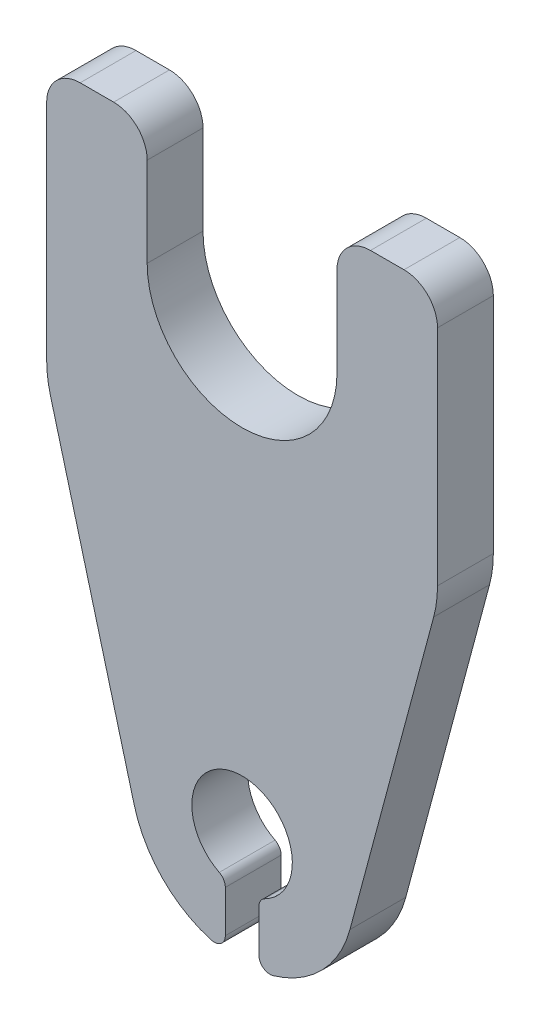
ISO-10303-21;
HEADER;
FILE_DESCRIPTION(('STEP AP214'),'2;1');
FILE_NAME('part.step','',(''),(''),'','','');
FILE_SCHEMA(('AUTOMOTIVE_DESIGN { 1 0 10303 214 1 1 1 1 }'));
ENDSEC;
DATA;
#1=APPLICATION_CONTEXT('core data for automotive mechanical design processes');
#2=APPLICATION_PROTOCOL_DEFINITION('international standard','automotive_design',2000,#1);
#3=PRODUCT_CONTEXT('',#1,'mechanical');
#4=PRODUCT('Part','Part','',(#3));
#5=PRODUCT_RELATED_PRODUCT_CATEGORY('part','',(#4));
#6=PRODUCT_DEFINITION_FORMATION('','',#4);
#7=PRODUCT_DEFINITION_CONTEXT('part definition',#1,'design');
#8=PRODUCT_DEFINITION('design','',#6,#7);
#9=PRODUCT_DEFINITION_SHAPE('','',#8);
#10=(LENGTH_UNIT() NAMED_UNIT(*) SI_UNIT(.MILLI.,.METRE.));
#11=(NAMED_UNIT(*) PLANE_ANGLE_UNIT() SI_UNIT($,.RADIAN.));
#12=(NAMED_UNIT(*) SI_UNIT($,.STERADIAN.) SOLID_ANGLE_UNIT());
#13=UNCERTAINTY_MEASURE_WITH_UNIT(LENGTH_MEASURE(1.E-05),#10,'distance_accuracy_value','');
#14=(GEOMETRIC_REPRESENTATION_CONTEXT(3) GLOBAL_UNCERTAINTY_ASSIGNED_CONTEXT((#13)) GLOBAL_UNIT_ASSIGNED_CONTEXT((#10,
#11,#12)) REPRESENTATION_CONTEXT('',''));
#15=CARTESIAN_POINT('',(0.,0.,0.));
#16=DIRECTION('',(0.,0.,1.));
#17=DIRECTION('',(1.,0.,0.));
#18=AXIS2_PLACEMENT_3D('',#15,#16,#17);
#19=CARTESIAN_POINT('',(0.,40.,5.));
#20=DIRECTION('',(0.,0.,-1.));
#21=DIRECTION('',(-1.,0.,0.));
#22=AXIS2_PLACEMENT_3D('',#19,#20,#21);
#23=CYLINDRICAL_SURFACE('',#22,8.5);
#24=CARTESIAN_POINT('',(0.,40.,0.));
#25=DIRECTION('',(0.,0.,-1.));
#26=DIRECTION('',(1.,0.,0.));
#27=AXIS2_PLACEMENT_3D('',#24,#25,#26);
#28=CIRCLE('',#27,8.5);
#29=CARTESIAN_POINT('',(8.5,40.,0.));
#30=VERTEX_POINT('',#29);
#31=CARTESIAN_POINT('',(-8.5,40.,0.));
#32=VERTEX_POINT('',#31);
#33=EDGE_CURVE('E231',#30,#32,#28,.T.);
#34=ORIENTED_EDGE('',*,*,#33,.T.);
#35=DIRECTION('',(0.,0.,-1.));
#36=VECTOR('',#35,1.);
#37=CARTESIAN_POINT('',(-8.5,40.,5.));
#38=LINE('',#37,#36);
#39=CARTESIAN_POINT('',(-8.5,40.,5.));
#40=VERTEX_POINT('',#39);
#41=EDGE_CURVE('E11',#40,#32,#38,.T.);
#42=ORIENTED_EDGE('',*,*,#41,.F.);
#43=CARTESIAN_POINT('',(0.,40.,5.));
#44=DIRECTION('',(0.,0.,-1.));
#45=DIRECTION('',(1.,0.,0.));
#46=AXIS2_PLACEMENT_3D('',#43,#44,#45);
#47=CIRCLE('',#46,8.5);
#48=CARTESIAN_POINT('',(8.5,40.,5.));
#49=VERTEX_POINT('',#48);
#50=EDGE_CURVE('E277',#49,#40,#47,.T.);
#51=ORIENTED_EDGE('',*,*,#50,.F.);
#52=DIRECTION('',(0.,0.,-1.));
#53=VECTOR('',#52,1.);
#54=CARTESIAN_POINT('',(8.5,40.,5.));
#55=LINE('',#54,#53);
#56=EDGE_CURVE('E227',#49,#30,#55,.T.);
#57=ORIENTED_EDGE('',*,*,#56,.T.);
#58=EDGE_LOOP('',(#34,#42,#51,#57));
#59=FACE_BOUND('',#58,.T.);
#60=ADVANCED_FACE('F39',(#59),#23,.F.);
#61=CARTESIAN_POINT('',(-8.5,40.,5.));
#62=DIRECTION('',(-1.,0.,0.));
#63=DIRECTION('',(0.,0.,1.));
#64=AXIS2_PLACEMENT_3D('',#61,#62,#63);
#65=PLANE('',#64);
#66=DIRECTION('',(0.,1.,0.));
#67=VECTOR('',#66,1.);
#68=CARTESIAN_POINT('',(-8.5,40.,0.));
#69=LINE('',#68,#67);
#70=CARTESIAN_POINT('',(-8.5,48.,0.));
#71=VERTEX_POINT('',#70);
#72=EDGE_CURVE('E234',#32,#71,#69,.T.);
#73=ORIENTED_EDGE('',*,*,#72,.T.);
#74=DIRECTION('',(0.,0.,-1.));
#75=VECTOR('',#74,1.);
#76=CARTESIAN_POINT('',(-8.5,48.,5.));
#77=LINE('',#76,#75);
#78=CARTESIAN_POINT('',(-8.5,48.,5.));
#79=VERTEX_POINT('',#78);
#80=EDGE_CURVE('E47',#79,#71,#77,.T.);
#81=ORIENTED_EDGE('',*,*,#80,.F.);
#82=DIRECTION('',(0.,1.,0.));
#83=VECTOR('',#82,1.);
#84=CARTESIAN_POINT('',(-8.5,40.,5.));
#85=LINE('',#84,#83);
#86=EDGE_CURVE('E146',#40,#79,#85,.T.);
#87=ORIENTED_EDGE('',*,*,#86,.F.);
#88=ORIENTED_EDGE('',*,*,#41,.T.);
#89=EDGE_LOOP('',(#73,#81,#87,#88));
#90=FACE_BOUND('',#89,.T.);
#91=ADVANCED_FACE('F415',(#90),#65,.F.);
#92=CARTESIAN_POINT('',(-11.5,48.,5.));
#93=DIRECTION('',(0.,0.,-1.));
#94=DIRECTION('',(-1.,0.,0.));
#95=AXIS2_PLACEMENT_3D('',#92,#93,#94);
#96=CYLINDRICAL_SURFACE('',#95,3.);
#97=CARTESIAN_POINT('',(-11.5,48.,0.));
#98=DIRECTION('',(0.,0.,1.));
#99=DIRECTION('',(1.,0.,0.));
#100=AXIS2_PLACEMENT_3D('',#97,#98,#99);
#101=CIRCLE('',#100,3.);
#102=CARTESIAN_POINT('',(-11.5,51.,0.));
#103=VERTEX_POINT('',#102);
#104=EDGE_CURVE('E236',#71,#103,#101,.T.);
#105=ORIENTED_EDGE('',*,*,#104,.T.);
#106=DIRECTION('',(0.,0.,-1.));
#107=VECTOR('',#106,1.);
#108=CARTESIAN_POINT('',(-11.5,51.,5.));
#109=LINE('',#108,#107);
#110=CARTESIAN_POINT('',(-11.5,51.,5.));
#111=VERTEX_POINT('',#110);
#112=EDGE_CURVE('E332',#111,#103,#109,.T.);
#113=ORIENTED_EDGE('',*,*,#112,.F.);
#114=CARTESIAN_POINT('',(-11.5,48.,5.));
#115=DIRECTION('',(0.,0.,1.));
#116=DIRECTION('',(1.,0.,0.));
#117=AXIS2_PLACEMENT_3D('',#114,#115,#116);
#118=CIRCLE('',#117,3.);
#119=EDGE_CURVE('E340',#79,#111,#118,.T.);
#120=ORIENTED_EDGE('',*,*,#119,.F.);
#121=ORIENTED_EDGE('',*,*,#80,.T.);
#122=EDGE_LOOP('',(#105,#113,#120,#121));
#123=FACE_BOUND('',#122,.T.);
#124=ADVANCED_FACE('F338',(#123),#96,.T.);
#125=CARTESIAN_POINT('',(-11.5,51.,5.));
#126=DIRECTION('',(0.,-1.,0.));
#127=DIRECTION('',(0.,0.,-1.));
#128=AXIS2_PLACEMENT_3D('',#125,#126,#127);
#129=PLANE('',#128);
#130=DIRECTION('',(-1.,0.,0.));
#131=VECTOR('',#130,1.);
#132=CARTESIAN_POINT('',(-11.5,51.,0.));
#133=LINE('',#132,#131);
#134=CARTESIAN_POINT('',(-14.5,51.,0.));
#135=VERTEX_POINT('',#134);
#136=EDGE_CURVE('E238',#103,#135,#133,.T.);
#137=ORIENTED_EDGE('',*,*,#136,.T.);
#138=DIRECTION('',(0.,0.,-1.));
#139=VECTOR('',#138,1.);
#140=CARTESIAN_POINT('',(-14.5,51.,5.));
#141=LINE('',#140,#139);
#142=CARTESIAN_POINT('',(-14.5,51.,5.));
#143=VERTEX_POINT('',#142);
#144=EDGE_CURVE('E329',#143,#135,#141,.T.);
#145=ORIENTED_EDGE('',*,*,#144,.F.);
#146=DIRECTION('',(-1.,0.,0.));
#147=VECTOR('',#146,1.);
#148=CARTESIAN_POINT('',(-11.5,51.,5.));
#149=LINE('',#148,#147);
#150=EDGE_CURVE('E358',#111,#143,#149,.T.);
#151=ORIENTED_EDGE('',*,*,#150,.F.);
#152=ORIENTED_EDGE('',*,*,#112,.T.);
#153=EDGE_LOOP('',(#137,#145,#151,#152));
#154=FACE_BOUND('',#153,.T.);
#155=ADVANCED_FACE('F349',(#154),#129,.F.);
#156=CARTESIAN_POINT('',(-14.5,48.,5.));
#157=DIRECTION('',(0.,0.,-1.));
#158=DIRECTION('',(-1.,0.,0.));
#159=AXIS2_PLACEMENT_3D('',#156,#157,#158);
#160=CYLINDRICAL_SURFACE('',#159,3.);
#161=CARTESIAN_POINT('',(-14.5,48.,0.));
#162=DIRECTION('',(0.,0.,1.));
#163=DIRECTION('',(-1.,0.,0.));
#164=AXIS2_PLACEMENT_3D('',#161,#162,#163);
#165=CIRCLE('',#164,3.);
#166=CARTESIAN_POINT('',(-17.5,48.,0.));
#167=VERTEX_POINT('',#166);
#168=EDGE_CURVE('E240',#135,#167,#165,.T.);
#169=ORIENTED_EDGE('',*,*,#168,.T.);
#170=DIRECTION('',(0.,0.,-1.));
#171=VECTOR('',#170,1.);
#172=CARTESIAN_POINT('',(-17.5,48.,5.));
#173=LINE('',#172,#171);
#174=CARTESIAN_POINT('',(-17.5,48.,5.));
#175=VERTEX_POINT('',#174);
#176=EDGE_CURVE('E326',#175,#167,#173,.T.);
#177=ORIENTED_EDGE('',*,*,#176,.F.);
#178=CARTESIAN_POINT('',(-14.5,48.,5.));
#179=DIRECTION('',(0.,0.,1.));
#180=DIRECTION('',(-1.,0.,0.));
#181=AXIS2_PLACEMENT_3D('',#178,#179,#180);
#182=CIRCLE('',#181,3.);
#183=EDGE_CURVE('E355',#143,#175,#182,.T.);
#184=ORIENTED_EDGE('',*,*,#183,.F.);
#185=ORIENTED_EDGE('',*,*,#144,.T.);
#186=EDGE_LOOP('',(#169,#177,#184,#185));
#187=FACE_BOUND('',#186,.T.);
#188=ADVANCED_FACE('F353',(#187),#160,.T.);
#189=CARTESIAN_POINT('',(-17.5,48.,5.));
#190=DIRECTION('',(1.,0.,0.));
#191=DIRECTION('',(0.,1.,0.));
#192=AXIS2_PLACEMENT_3D('',#189,#190,#191);
#193=PLANE('',#192);
#194=DIRECTION('',(0.,-1.,0.));
#195=VECTOR('',#194,1.);
#196=CARTESIAN_POINT('',(-17.5,48.,0.));
#197=LINE('',#196,#195);
#198=CARTESIAN_POINT('',(-17.5,27.9903810567665,0.));
#199=VERTEX_POINT('',#198);
#200=EDGE_CURVE('E242',#167,#199,#197,.T.);
#201=ORIENTED_EDGE('',*,*,#200,.T.);
#202=DIRECTION('',(0.,0.,-1.));
#203=VECTOR('',#202,1.);
#204=CARTESIAN_POINT('',(-17.5,27.9903810567665,5.));
#205=LINE('',#204,#203);
#206=CARTESIAN_POINT('',(-17.5,27.9903810567665,5.));
#207=VERTEX_POINT('',#206);
#208=EDGE_CURVE('E323',#207,#199,#205,.T.);
#209=ORIENTED_EDGE('',*,*,#208,.F.);
#210=DIRECTION('',(0.,-1.,0.));
#211=VECTOR('',#210,1.);
#212=CARTESIAN_POINT('',(-17.5,48.,5.));
#213=LINE('',#212,#211);
#214=EDGE_CURVE('E357',#175,#207,#213,.T.);
#215=ORIENTED_EDGE('',*,*,#214,.F.);
#216=ORIENTED_EDGE('',*,*,#176,.T.);
#217=EDGE_LOOP('',(#201,#209,#215,#216));
#218=FACE_BOUND('',#217,.T.);
#219=ADVANCED_FACE('F428',(#218),#193,.F.);
#220=CARTESIAN_POINT('',(-7.50000000000001,27.9903810567665,5.));
#221=DIRECTION('',(0.,0.,-1.));
#222=DIRECTION('',(-1.,0.,0.));
#223=AXIS2_PLACEMENT_3D('',#220,#221,#222);
#224=CYLINDRICAL_SURFACE('',#223,10.);
#225=CARTESIAN_POINT('',(-7.50000000000001,27.9903810567665,0.));
#226=DIRECTION('',(0.,0.,1.));
#227=DIRECTION('',(1.,0.,0.));
#228=AXIS2_PLACEMENT_3D('',#225,#226,#227);
#229=CIRCLE('',#228,10.);
#230=CARTESIAN_POINT('',(-17.1592582628907,25.4021906057413,0.));
#231=VERTEX_POINT('',#230);
#232=EDGE_CURVE('E244',#199,#231,#229,.T.);
#233=ORIENTED_EDGE('',*,*,#232,.T.);
#234=DIRECTION('',(0.,0.,-1.));
#235=VECTOR('',#234,1.);
#236=CARTESIAN_POINT('',(-17.1592582628907,25.4021906057413,5.));
#237=LINE('',#236,#235);
#238=CARTESIAN_POINT('',(-17.1592582628907,25.4021906057413,5.));
#239=VERTEX_POINT('',#238);
#240=EDGE_CURVE('E320',#239,#231,#237,.T.);
#241=ORIENTED_EDGE('',*,*,#240,.F.);
#242=CARTESIAN_POINT('',(-7.50000000000001,27.9903810567665,5.));
#243=DIRECTION('',(0.,0.,1.));
#244=DIRECTION('',(1.,0.,0.));
#245=AXIS2_PLACEMENT_3D('',#242,#243,#244);
#246=CIRCLE('',#245,10.);
#247=EDGE_CURVE('E360',#207,#239,#246,.T.);
#248=ORIENTED_EDGE('',*,*,#247,.F.);
#249=ORIENTED_EDGE('',*,*,#208,.T.);
#250=EDGE_LOOP('',(#233,#241,#248,#249));
#251=FACE_BOUND('',#250,.T.);
#252=ADVANCED_FACE('F431',(#251),#224,.T.);
#253=CARTESIAN_POINT('',(-17.1592582628907,25.4021906057413,5.));
#254=DIRECTION('',(0.965925826289068,0.258819045102521,0.));
#255=DIRECTION('',(-0.258819045102521,0.965925826289068,0.));
#256=AXIS2_PLACEMENT_3D('',#253,#254,#255);
#257=PLANE('',#256);
#258=DIRECTION('',(0.258819045102521,-0.965925826289068,0.));
#259=VECTOR('',#258,1.);
#260=CARTESIAN_POINT('',(-17.1592582628907,25.4021906057413,0.));
#261=LINE('',#260,#259);
#262=CARTESIAN_POINT('',(-9.65925826289068,-2.58819045102521,0.));
#263=VERTEX_POINT('',#262);
#264=EDGE_CURVE('E246',#231,#263,#261,.T.);
#265=ORIENTED_EDGE('',*,*,#264,.T.);
#266=DIRECTION('',(0.,0.,-1.));
#267=VECTOR('',#266,1.);
#268=CARTESIAN_POINT('',(-9.65925826289068,-2.58819045102521,5.));
#269=LINE('',#268,#267);
#270=CARTESIAN_POINT('',(-9.65925826289068,-2.58819045102521,5.));
#271=VERTEX_POINT('',#270);
#272=EDGE_CURVE('E317',#271,#263,#269,.T.);
#273=ORIENTED_EDGE('',*,*,#272,.F.);
#274=DIRECTION('',(0.258819045102521,-0.965925826289068,0.));
#275=VECTOR('',#274,1.);
#276=CARTESIAN_POINT('',(-17.1592582628907,25.4021906057413,5.));
#277=LINE('',#276,#275);
#278=EDGE_CURVE('E366',#239,#271,#277,.T.);
#279=ORIENTED_EDGE('',*,*,#278,.F.);
#280=ORIENTED_EDGE('',*,*,#240,.T.);
#281=EDGE_LOOP('',(#265,#273,#279,#280));
#282=FACE_BOUND('',#281,.T.);
#283=ADVANCED_FACE('F435',(#282),#257,.F.);
#284=CARTESIAN_POINT('',(0.,0.,5.));
#285=DIRECTION('',(0.,0.,-1.));
#286=DIRECTION('',(-1.,0.,0.));
#287=AXIS2_PLACEMENT_3D('',#284,#285,#286);
#288=CYLINDRICAL_SURFACE('',#287,10.);
#289=CARTESIAN_POINT('',(0.,0.,0.));
#290=DIRECTION('',(0.,0.,1.));
#291=DIRECTION('',(1.,0.,0.));
#292=AXIS2_PLACEMENT_3D('',#289,#290,#291);
#293=CIRCLE('',#292,10.);
#294=CARTESIAN_POINT('',(-2.77777777777778,-9.60645359210588,0.));
#295=VERTEX_POINT('',#294);
#296=EDGE_CURVE('E248',#263,#295,#293,.T.);
#297=ORIENTED_EDGE('',*,*,#296,.T.);
#298=DIRECTION('',(0.,0.,-1.));
#299=VECTOR('',#298,1.);
#300=CARTESIAN_POINT('',(-2.77777777777778,-9.60645359210588,5.));
#301=LINE('',#300,#299);
#302=CARTESIAN_POINT('',(-2.77777777777778,-9.60645359210588,5.));
#303=VERTEX_POINT('',#302);
#304=EDGE_CURVE('E314',#303,#295,#301,.T.);
#305=ORIENTED_EDGE('',*,*,#304,.F.);
#306=CARTESIAN_POINT('',(0.,0.,5.));
#307=DIRECTION('',(0.,0.,1.));
#308=DIRECTION('',(1.,0.,0.));
#309=AXIS2_PLACEMENT_3D('',#306,#307,#308);
#310=CIRCLE('',#309,10.);
#311=EDGE_CURVE('E368',#271,#303,#310,.T.);
#312=ORIENTED_EDGE('',*,*,#311,.F.);
#313=ORIENTED_EDGE('',*,*,#272,.T.);
#314=EDGE_LOOP('',(#297,#305,#312,#313));
#315=FACE_BOUND('',#314,.T.);
#316=ADVANCED_FACE('F439',(#315),#288,.T.);
#317=CARTESIAN_POINT('',(-2.5,-8.64580823289529,5.));
#318=DIRECTION('',(0.,0.,-1.));
#319=DIRECTION('',(-1.,0.,0.));
#320=AXIS2_PLACEMENT_3D('',#317,#318,#319);
#321=CYLINDRICAL_SURFACE('',#320,0.999999999999999);
#322=CARTESIAN_POINT('',(-2.5,-8.64580823289529,0.));
#323=DIRECTION('',(0.,0.,1.));
#324=DIRECTION('',(1.,0.,0.));
#325=AXIS2_PLACEMENT_3D('',#322,#323,#324);
#326=CIRCLE('',#325,0.999999999999999);
#327=CARTESIAN_POINT('',(-1.5,-8.64580823289529,0.));
#328=VERTEX_POINT('',#327);
#329=EDGE_CURVE('E250',#295,#328,#326,.T.);
#330=ORIENTED_EDGE('',*,*,#329,.T.);
#331=DIRECTION('',(0.,0.,-1.));
#332=VECTOR('',#331,1.);
#333=CARTESIAN_POINT('',(-1.5,-8.64580823289529,5.));
#334=LINE('',#333,#332);
#335=CARTESIAN_POINT('',(-1.5,-8.64580823289529,5.));
#336=VERTEX_POINT('',#335);
#337=EDGE_CURVE('E311',#336,#328,#334,.T.);
#338=ORIENTED_EDGE('',*,*,#337,.F.);
#339=CARTESIAN_POINT('',(-2.5,-8.64580823289529,5.));
#340=DIRECTION('',(0.,0.,1.));
#341=DIRECTION('',(1.,0.,0.));
#342=AXIS2_PLACEMENT_3D('',#339,#340,#341);
#343=CIRCLE('',#342,0.999999999999999);
#344=EDGE_CURVE('E370',#303,#336,#343,.T.);
#345=ORIENTED_EDGE('',*,*,#344,.F.);
#346=ORIENTED_EDGE('',*,*,#304,.T.);
#347=EDGE_LOOP('',(#330,#338,#345,#346));
#348=FACE_BOUND('',#347,.T.);
#349=ADVANCED_FACE('F443',(#348),#321,.T.);
#350=CARTESIAN_POINT('',(-1.5,-4.89897948556636,5.));
#351=DIRECTION('',(-1.,0.,0.));
#352=DIRECTION('',(0.,-1.,0.));
#353=AXIS2_PLACEMENT_3D('',#350,#351,#352);
#354=PLANE('',#353);
#355=DIRECTION('',(0.,1.,0.));
#356=VECTOR('',#355,1.);
#357=CARTESIAN_POINT('',(-1.5,-4.89897948556636,0.));
#358=LINE('',#357,#356);
#359=CARTESIAN_POINT('',(-1.5,-4.89897948556636,0.));
#360=VERTEX_POINT('',#359);
#361=EDGE_CURVE('E252',#328,#360,#358,.T.);
#362=ORIENTED_EDGE('',*,*,#361,.T.);
#363=DIRECTION('',(0.,0.,-1.));
#364=VECTOR('',#363,1.);
#365=CARTESIAN_POINT('',(-1.5,-4.89897948556636,5.));
#366=LINE('',#365,#364);
#367=CARTESIAN_POINT('',(-1.5,-4.89897948556636,5.));
#368=VERTEX_POINT('',#367);
#369=EDGE_CURVE('E308',#368,#360,#366,.T.);
#370=ORIENTED_EDGE('',*,*,#369,.F.);
#371=DIRECTION('',(0.,1.,0.));
#372=VECTOR('',#371,1.);
#373=CARTESIAN_POINT('',(-1.5,-4.89897948556636,5.));
#374=LINE('',#373,#372);
#375=EDGE_CURVE('E372',#336,#368,#374,.T.);
#376=ORIENTED_EDGE('',*,*,#375,.F.);
#377=ORIENTED_EDGE('',*,*,#337,.T.);
#378=EDGE_LOOP('',(#362,#370,#376,#377));
#379=FACE_BOUND('',#378,.T.);
#380=ADVANCED_FACE('F447',(#379),#354,.F.);
#381=CARTESIAN_POINT('',(-2.5,-4.89897948556636,5.));
#382=DIRECTION('',(0.,0.,-1.));
#383=DIRECTION('',(-1.,0.,0.));
#384=AXIS2_PLACEMENT_3D('',#381,#382,#383);
#385=CYLINDRICAL_SURFACE('',#384,1.);
#386=CARTESIAN_POINT('',(-2.5,-4.89897948556636,0.));
#387=DIRECTION('',(0.,0.,1.));
#388=DIRECTION('',(-1.,0.,0.));
#389=AXIS2_PLACEMENT_3D('',#386,#387,#388);
#390=CIRCLE('',#389,1.);
#391=CARTESIAN_POINT('',(-2.04545454545454,-4.00825594273611,0.));
#392=VERTEX_POINT('',#391);
#393=EDGE_CURVE('E254',#360,#392,#390,.T.);
#394=ORIENTED_EDGE('',*,*,#393,.T.);
#395=DIRECTION('',(0.,0.,-1.));
#396=VECTOR('',#395,1.);
#397=CARTESIAN_POINT('',(-2.04545454545454,-4.00825594273611,5.));
#398=LINE('',#397,#396);
#399=CARTESIAN_POINT('',(-2.04545454545454,-4.00825594273611,5.));
#400=VERTEX_POINT('',#399);
#401=EDGE_CURVE('E305',#400,#392,#398,.T.);
#402=ORIENTED_EDGE('',*,*,#401,.F.);
#403=CARTESIAN_POINT('',(-2.5,-4.89897948556636,5.));
#404=DIRECTION('',(0.,0.,1.));
#405=DIRECTION('',(-1.,0.,0.));
#406=AXIS2_PLACEMENT_3D('',#403,#404,#405);
#407=CIRCLE('',#406,1.);
#408=EDGE_CURVE('E374',#368,#400,#407,.T.);
#409=ORIENTED_EDGE('',*,*,#408,.F.);
#410=ORIENTED_EDGE('',*,*,#369,.T.);
#411=EDGE_LOOP('',(#394,#402,#409,#410));
#412=FACE_BOUND('',#411,.T.);
#413=ADVANCED_FACE('F451',(#412),#385,.T.);
#414=CARTESIAN_POINT('',(0.,0.,5.));
#415=DIRECTION('',(0.,0.,-1.));
#416=DIRECTION('',(-1.,0.,0.));
#417=AXIS2_PLACEMENT_3D('',#414,#415,#416);
#418=CYLINDRICAL_SURFACE('',#417,4.5);
#419=CARTESIAN_POINT('',(0.,0.,0.));
#420=DIRECTION('',(0.,0.,-1.));
#421=DIRECTION('',(1.,0.,0.));
#422=AXIS2_PLACEMENT_3D('',#419,#420,#421);
#423=CIRCLE('',#422,4.5);
#424=CARTESIAN_POINT('',(2.04545454545455,-4.00825594273611,0.));
#425=VERTEX_POINT('',#424);
#426=EDGE_CURVE('E256',#392,#425,#423,.T.);
#427=ORIENTED_EDGE('',*,*,#426,.T.);
#428=DIRECTION('',(0.,0.,-1.));
#429=VECTOR('',#428,1.);
#430=CARTESIAN_POINT('',(2.04545454545455,-4.00825594273611,5.));
#431=LINE('',#430,#429);
#432=CARTESIAN_POINT('',(2.04545454545455,-4.00825594273611,5.));
#433=VERTEX_POINT('',#432);
#434=EDGE_CURVE('E302',#433,#425,#431,.T.);
#435=ORIENTED_EDGE('',*,*,#434,.F.);
#436=CARTESIAN_POINT('',(0.,0.,5.));
#437=DIRECTION('',(0.,0.,-1.));
#438=DIRECTION('',(1.,0.,0.));
#439=AXIS2_PLACEMENT_3D('',#436,#437,#438);
#440=CIRCLE('',#439,4.5);
#441=EDGE_CURVE('E376',#400,#433,#440,.T.);
#442=ORIENTED_EDGE('',*,*,#441,.F.);
#443=ORIENTED_EDGE('',*,*,#401,.T.);
#444=EDGE_LOOP('',(#427,#435,#442,#443));
#445=FACE_BOUND('',#444,.T.);
#446=ADVANCED_FACE('F455',(#445),#418,.F.);
#447=CARTESIAN_POINT('',(2.5,-4.89897948556636,5.));
#448=DIRECTION('',(0.,0.,-1.));
#449=DIRECTION('',(-1.,0.,0.));
#450=AXIS2_PLACEMENT_3D('',#447,#448,#449);
#451=CYLINDRICAL_SURFACE('',#450,1.);
#452=CARTESIAN_POINT('',(2.5,-4.89897948556636,0.));
#453=DIRECTION('',(0.,0.,1.));
#454=DIRECTION('',(1.,0.,0.));
#455=AXIS2_PLACEMENT_3D('',#452,#453,#454);
#456=CIRCLE('',#455,1.);
#457=CARTESIAN_POINT('',(1.5,-4.89897948556636,0.));
#458=VERTEX_POINT('',#457);
#459=EDGE_CURVE('E258',#425,#458,#456,.T.);
#460=ORIENTED_EDGE('',*,*,#459,.T.);
#461=DIRECTION('',(0.,0.,-1.));
#462=VECTOR('',#461,1.);
#463=CARTESIAN_POINT('',(1.5,-4.89897948556636,5.));
#464=LINE('',#463,#462);
#465=CARTESIAN_POINT('',(1.5,-4.89897948556636,5.));
#466=VERTEX_POINT('',#465);
#467=EDGE_CURVE('E299',#466,#458,#464,.T.);
#468=ORIENTED_EDGE('',*,*,#467,.F.);
#469=CARTESIAN_POINT('',(2.5,-4.89897948556636,5.));
#470=DIRECTION('',(0.,0.,1.));
#471=DIRECTION('',(1.,0.,0.));
#472=AXIS2_PLACEMENT_3D('',#469,#470,#471);
#473=CIRCLE('',#472,1.);
#474=EDGE_CURVE('E378',#433,#466,#473,.T.);
#475=ORIENTED_EDGE('',*,*,#474,.F.);
#476=ORIENTED_EDGE('',*,*,#434,.T.);
#477=EDGE_LOOP('',(#460,#468,#475,#476));
#478=FACE_BOUND('',#477,.T.);
#479=ADVANCED_FACE('F459',(#478),#451,.T.);
#480=CARTESIAN_POINT('',(1.5,-4.89897948556636,5.));
#481=DIRECTION('',(1.,0.,0.));
#482=DIRECTION('',(0.,1.,0.));
#483=AXIS2_PLACEMENT_3D('',#480,#481,#482);
#484=PLANE('',#483);
#485=DIRECTION('',(0.,-1.,0.));
#486=VECTOR('',#485,1.);
#487=CARTESIAN_POINT('',(1.5,-4.89897948556636,0.));
#488=LINE('',#487,#486);
#489=CARTESIAN_POINT('',(1.5,-8.64580823289529,0.));
#490=VERTEX_POINT('',#489);
#491=EDGE_CURVE('E260',#458,#490,#488,.T.);
#492=ORIENTED_EDGE('',*,*,#491,.T.);
#493=DIRECTION('',(0.,0.,-1.));
#494=VECTOR('',#493,1.);
#495=CARTESIAN_POINT('',(1.5,-8.64580823289529,5.));
#496=LINE('',#495,#494);
#497=CARTESIAN_POINT('',(1.5,-8.64580823289529,5.));
#498=VERTEX_POINT('',#497);
#499=EDGE_CURVE('E296',#498,#490,#496,.T.);
#500=ORIENTED_EDGE('',*,*,#499,.F.);
#501=DIRECTION('',(0.,-1.,0.));
#502=VECTOR('',#501,1.);
#503=CARTESIAN_POINT('',(1.5,-4.89897948556636,5.));
#504=LINE('',#503,#502);
#505=EDGE_CURVE('E380',#466,#498,#504,.T.);
#506=ORIENTED_EDGE('',*,*,#505,.F.);
#507=ORIENTED_EDGE('',*,*,#467,.T.);
#508=EDGE_LOOP('',(#492,#500,#506,#507));
#509=FACE_BOUND('',#508,.T.);
#510=ADVANCED_FACE('F463',(#509),#484,.F.);
#511=CARTESIAN_POINT('',(2.5,-8.64580823289529,5.));
#512=DIRECTION('',(0.,0.,-1.));
#513=DIRECTION('',(-1.,0.,0.));
#514=AXIS2_PLACEMENT_3D('',#511,#512,#513);
#515=CYLINDRICAL_SURFACE('',#514,0.999999999999999);
#516=CARTESIAN_POINT('',(2.5,-8.64580823289529,0.));
#517=DIRECTION('',(0.,0.,1.));
#518=DIRECTION('',(-1.,0.,0.));
#519=AXIS2_PLACEMENT_3D('',#516,#517,#518);
#520=CIRCLE('',#519,0.999999999999999);
#521=CARTESIAN_POINT('',(2.77777777777777,-9.60645359210588,0.));
#522=VERTEX_POINT('',#521);
#523=EDGE_CURVE('E262',#490,#522,#520,.T.);
#524=ORIENTED_EDGE('',*,*,#523,.T.);
#525=DIRECTION('',(0.,0.,-1.));
#526=VECTOR('',#525,1.);
#527=CARTESIAN_POINT('',(2.77777777777777,-9.60645359210588,5.));
#528=LINE('',#527,#526);
#529=CARTESIAN_POINT('',(2.77777777777777,-9.60645359210588,5.));
#530=VERTEX_POINT('',#529);
#531=EDGE_CURVE('E293',#530,#522,#528,.T.);
#532=ORIENTED_EDGE('',*,*,#531,.F.);
#533=CARTESIAN_POINT('',(2.5,-8.64580823289529,5.));
#534=DIRECTION('',(0.,0.,1.));
#535=DIRECTION('',(-1.,0.,0.));
#536=AXIS2_PLACEMENT_3D('',#533,#534,#535);
#537=CIRCLE('',#536,0.999999999999999);
#538=EDGE_CURVE('E382',#498,#530,#537,.T.);
#539=ORIENTED_EDGE('',*,*,#538,.F.);
#540=ORIENTED_EDGE('',*,*,#499,.T.);
#541=EDGE_LOOP('',(#524,#532,#539,#540));
#542=FACE_BOUND('',#541,.T.);
#543=ADVANCED_FACE('F467',(#542),#515,.T.);
#544=CARTESIAN_POINT('',(0.,0.,5.));
#545=DIRECTION('',(0.,0.,-1.));
#546=DIRECTION('',(-1.,0.,0.));
#547=AXIS2_PLACEMENT_3D('',#544,#545,#546);
#548=CYLINDRICAL_SURFACE('',#547,10.);
#549=CARTESIAN_POINT('',(0.,0.,0.));
#550=DIRECTION('',(0.,0.,1.));
#551=DIRECTION('',(1.,0.,0.));
#552=AXIS2_PLACEMENT_3D('',#549,#550,#551);
#553=CIRCLE('',#552,10.);
#554=CARTESIAN_POINT('',(9.65925826289068,-2.58819045102521,0.));
#555=VERTEX_POINT('',#554);
#556=EDGE_CURVE('E264',#522,#555,#553,.T.);
#557=ORIENTED_EDGE('',*,*,#556,.T.);
#558=DIRECTION('',(0.,0.,-1.));
#559=VECTOR('',#558,1.);
#560=CARTESIAN_POINT('',(9.65925826289068,-2.58819045102521,5.));
#561=LINE('',#560,#559);
#562=CARTESIAN_POINT('',(9.65925826289068,-2.58819045102521,5.));
#563=VERTEX_POINT('',#562);
#564=EDGE_CURVE('E290',#563,#555,#561,.T.);
#565=ORIENTED_EDGE('',*,*,#564,.F.);
#566=CARTESIAN_POINT('',(0.,0.,5.));
#567=DIRECTION('',(0.,0.,1.));
#568=DIRECTION('',(1.,0.,0.));
#569=AXIS2_PLACEMENT_3D('',#566,#567,#568);
#570=CIRCLE('',#569,10.);
#571=EDGE_CURVE('E384',#530,#563,#570,.T.);
#572=ORIENTED_EDGE('',*,*,#571,.F.);
#573=ORIENTED_EDGE('',*,*,#531,.T.);
#574=EDGE_LOOP('',(#557,#565,#572,#573));
#575=FACE_BOUND('',#574,.T.);
#576=ADVANCED_FACE('F471',(#575),#548,.T.);
#577=CARTESIAN_POINT('',(17.1592582628907,25.4021906057413,5.));
#578=DIRECTION('',(-0.965925826289068,0.258819045102521,0.));
#579=DIRECTION('',(-0.258819045102521,-0.965925826289068,0.));
#580=AXIS2_PLACEMENT_3D('',#577,#578,#579);
#581=PLANE('',#580);
#582=DIRECTION('',(0.258819045102521,0.965925826289068,0.));
#583=VECTOR('',#582,1.);
#584=CARTESIAN_POINT('',(17.1592582628907,25.4021906057413,0.));
#585=LINE('',#584,#583);
#586=CARTESIAN_POINT('',(17.1592582628907,25.4021906057413,0.));
#587=VERTEX_POINT('',#586);
#588=EDGE_CURVE('E266',#555,#587,#585,.T.);
#589=ORIENTED_EDGE('',*,*,#588,.T.);
#590=DIRECTION('',(0.,0.,-1.));
#591=VECTOR('',#590,1.);
#592=CARTESIAN_POINT('',(17.1592582628907,25.4021906057413,5.));
#593=LINE('',#592,#591);
#594=CARTESIAN_POINT('',(17.1592582628907,25.4021906057413,5.));
#595=VERTEX_POINT('',#594);
#596=EDGE_CURVE('E287',#595,#587,#593,.T.);
#597=ORIENTED_EDGE('',*,*,#596,.F.);
#598=DIRECTION('',(0.258819045102521,0.965925826289068,0.));
#599=VECTOR('',#598,1.);
#600=CARTESIAN_POINT('',(17.1592582628907,25.4021906057413,5.));
#601=LINE('',#600,#599);
#602=EDGE_CURVE('E386',#563,#595,#601,.T.);
#603=ORIENTED_EDGE('',*,*,#602,.F.);
#604=ORIENTED_EDGE('',*,*,#564,.T.);
#605=EDGE_LOOP('',(#589,#597,#603,#604));
#606=FACE_BOUND('',#605,.T.);
#607=ADVANCED_FACE('F475',(#606),#581,.F.);
#608=CARTESIAN_POINT('',(7.50000000000001,27.9903810567665,5.));
#609=DIRECTION('',(0.,0.,-1.));
#610=DIRECTION('',(-1.,0.,0.));
#611=AXIS2_PLACEMENT_3D('',#608,#609,#610);
#612=CYLINDRICAL_SURFACE('',#611,10.);
#613=CARTESIAN_POINT('',(7.50000000000001,27.9903810567665,0.));
#614=DIRECTION('',(0.,0.,1.));
#615=DIRECTION('',(1.,0.,0.));
#616=AXIS2_PLACEMENT_3D('',#613,#614,#615);
#617=CIRCLE('',#616,10.);
#618=CARTESIAN_POINT('',(17.5,27.9903810567665,0.));
#619=VERTEX_POINT('',#618);
#620=EDGE_CURVE('E268',#587,#619,#617,.T.);
#621=ORIENTED_EDGE('',*,*,#620,.T.);
#622=DIRECTION('',(0.,0.,-1.));
#623=VECTOR('',#622,1.);
#624=CARTESIAN_POINT('',(17.5,27.9903810567665,5.));
#625=LINE('',#624,#623);
#626=CARTESIAN_POINT('',(17.5,27.9903810567665,5.));
#627=VERTEX_POINT('',#626);
#628=EDGE_CURVE('E284',#627,#619,#625,.T.);
#629=ORIENTED_EDGE('',*,*,#628,.F.);
#630=CARTESIAN_POINT('',(7.50000000000001,27.9903810567665,5.));
#631=DIRECTION('',(0.,0.,1.));
#632=DIRECTION('',(1.,0.,0.));
#633=AXIS2_PLACEMENT_3D('',#630,#631,#632);
#634=CIRCLE('',#633,10.);
#635=EDGE_CURVE('E388',#595,#627,#634,.T.);
#636=ORIENTED_EDGE('',*,*,#635,.F.);
#637=ORIENTED_EDGE('',*,*,#596,.T.);
#638=EDGE_LOOP('',(#621,#629,#636,#637));
#639=FACE_BOUND('',#638,.T.);
#640=ADVANCED_FACE('F479',(#639),#612,.T.);
#641=CARTESIAN_POINT('',(17.5,48.,5.));
#642=DIRECTION('',(-1.,0.,0.));
#643=DIRECTION('',(0.,-1.,0.));
#644=AXIS2_PLACEMENT_3D('',#641,#642,#643);
#645=PLANE('',#644);
#646=DIRECTION('',(0.,1.,0.));
#647=VECTOR('',#646,1.);
#648=CARTESIAN_POINT('',(17.5,48.,0.));
#649=LINE('',#648,#647);
#650=CARTESIAN_POINT('',(17.5,48.,0.));
#651=VERTEX_POINT('',#650);
#652=EDGE_CURVE('E270',#619,#651,#649,.T.);
#653=ORIENTED_EDGE('',*,*,#652,.T.);
#654=DIRECTION('',(0.,0.,-1.));
#655=VECTOR('',#654,1.);
#656=CARTESIAN_POINT('',(17.5,48.,5.));
#657=LINE('',#656,#655);
#658=CARTESIAN_POINT('',(17.5,48.,5.));
#659=VERTEX_POINT('',#658);
#660=EDGE_CURVE('E281',#659,#651,#657,.T.);
#661=ORIENTED_EDGE('',*,*,#660,.F.);
#662=DIRECTION('',(0.,1.,0.));
#663=VECTOR('',#662,1.);
#664=CARTESIAN_POINT('',(17.5,48.,5.));
#665=LINE('',#664,#663);
#666=EDGE_CURVE('E390',#627,#659,#665,.T.);
#667=ORIENTED_EDGE('',*,*,#666,.F.);
#668=ORIENTED_EDGE('',*,*,#628,.T.);
#669=EDGE_LOOP('',(#653,#661,#667,#668));
#670=FACE_BOUND('',#669,.T.);
#671=ADVANCED_FACE('F396',(#670),#645,.F.);
#672=CARTESIAN_POINT('',(14.5,48.,5.));
#673=DIRECTION('',(0.,0.,-1.));
#674=DIRECTION('',(-1.,0.,0.));
#675=AXIS2_PLACEMENT_3D('',#672,#673,#674);
#676=CYLINDRICAL_SURFACE('',#675,3.);
#677=CARTESIAN_POINT('',(14.5,48.,0.));
#678=DIRECTION('',(0.,0.,1.));
#679=DIRECTION('',(1.,0.,0.));
#680=AXIS2_PLACEMENT_3D('',#677,#678,#679);
#681=CIRCLE('',#680,3.);
#682=CARTESIAN_POINT('',(14.5,51.,0.));
#683=VERTEX_POINT('',#682);
#684=EDGE_CURVE('E272',#651,#683,#681,.T.);
#685=ORIENTED_EDGE('',*,*,#684,.T.);
#686=DIRECTION('',(0.,0.,-1.));
#687=VECTOR('',#686,1.);
#688=CARTESIAN_POINT('',(14.5,51.,5.));
#689=LINE('',#688,#687);
#690=CARTESIAN_POINT('',(14.5,51.,5.));
#691=VERTEX_POINT('',#690);
#692=EDGE_CURVE('E222',#691,#683,#689,.T.);
#693=ORIENTED_EDGE('',*,*,#692,.F.);
#694=CARTESIAN_POINT('',(14.5,48.,5.));
#695=DIRECTION('',(0.,0.,1.));
#696=DIRECTION('',(1.,0.,0.));
#697=AXIS2_PLACEMENT_3D('',#694,#695,#696);
#698=CIRCLE('',#697,3.);
#699=EDGE_CURVE('E213',#659,#691,#698,.T.);
#700=ORIENTED_EDGE('',*,*,#699,.F.);
#701=ORIENTED_EDGE('',*,*,#660,.T.);
#702=EDGE_LOOP('',(#685,#693,#700,#701));
#703=FACE_BOUND('',#702,.T.);
#704=ADVANCED_FACE('F400',(#703),#676,.T.);
#705=CARTESIAN_POINT('',(11.5,51.,5.));
#706=DIRECTION('',(0.,-1.,0.));
#707=DIRECTION('',(0.,0.,-1.));
#708=AXIS2_PLACEMENT_3D('',#705,#706,#707);
#709=PLANE('',#708);
#710=DIRECTION('',(-1.,0.,0.));
#711=VECTOR('',#710,1.);
#712=CARTESIAN_POINT('',(11.5,51.,0.));
#713=LINE('',#712,#711);
#714=CARTESIAN_POINT('',(11.5,51.,0.));
#715=VERTEX_POINT('',#714);
#716=EDGE_CURVE('E221',#683,#715,#713,.T.);
#717=ORIENTED_EDGE('',*,*,#716,.T.);
#718=DIRECTION('',(0.,0.,-1.));
#719=VECTOR('',#718,1.);
#720=CARTESIAN_POINT('',(11.5,51.,5.));
#721=LINE('',#720,#719);
#722=CARTESIAN_POINT('',(11.5,51.,5.));
#723=VERTEX_POINT('',#722);
#724=EDGE_CURVE('E218',#723,#715,#721,.T.);
#725=ORIENTED_EDGE('',*,*,#724,.F.);
#726=DIRECTION('',(-1.,0.,0.));
#727=VECTOR('',#726,1.);
#728=CARTESIAN_POINT('',(11.5,51.,5.));
#729=LINE('',#728,#727);
#730=EDGE_CURVE('E207',#691,#723,#729,.T.);
#731=ORIENTED_EDGE('',*,*,#730,.F.);
#732=ORIENTED_EDGE('',*,*,#692,.T.);
#733=EDGE_LOOP('',(#717,#725,#731,#732));
#734=FACE_BOUND('',#733,.T.);
#735=ADVANCED_FACE('F219',(#734),#709,.F.);
#736=CARTESIAN_POINT('',(11.5,48.,5.));
#737=DIRECTION('',(0.,0.,-1.));
#738=DIRECTION('',(-1.,0.,0.));
#739=AXIS2_PLACEMENT_3D('',#736,#737,#738);
#740=CYLINDRICAL_SURFACE('',#739,3.);
#741=CARTESIAN_POINT('',(11.5,48.,0.));
#742=DIRECTION('',(0.,0.,1.));
#743=DIRECTION('',(1.,0.,0.));
#744=AXIS2_PLACEMENT_3D('',#741,#742,#743);
#745=CIRCLE('',#744,3.);
#746=CARTESIAN_POINT('',(8.5,48.,0.));
#747=VERTEX_POINT('',#746);
#748=EDGE_CURVE('E132',#715,#747,#745,.T.);
#749=ORIENTED_EDGE('',*,*,#748,.T.);
#750=DIRECTION('',(0.,0.,-1.));
#751=VECTOR('',#750,1.);
#752=CARTESIAN_POINT('',(8.5,48.,5.));
#753=LINE('',#752,#751);
#754=CARTESIAN_POINT('',(8.5,48.,5.));
#755=VERTEX_POINT('',#754);
#756=EDGE_CURVE('E223',#755,#747,#753,.T.);
#757=ORIENTED_EDGE('',*,*,#756,.F.);
#758=CARTESIAN_POINT('',(11.5,48.,5.));
#759=DIRECTION('',(0.,0.,1.));
#760=DIRECTION('',(1.,0.,0.));
#761=AXIS2_PLACEMENT_3D('',#758,#759,#760);
#762=CIRCLE('',#761,3.);
#763=EDGE_CURVE('E211',#723,#755,#762,.T.);
#764=ORIENTED_EDGE('',*,*,#763,.F.);
#765=ORIENTED_EDGE('',*,*,#724,.T.);
#766=EDGE_LOOP('',(#749,#757,#764,#765));
#767=FACE_BOUND('',#766,.T.);
#768=ADVANCED_FACE('F225',(#767),#740,.T.);
#769=CARTESIAN_POINT('',(8.5,40.,5.));
#770=DIRECTION('',(1.,0.,0.));
#771=DIRECTION('',(0.,0.,-1.));
#772=AXIS2_PLACEMENT_3D('',#769,#770,#771);
#773=PLANE('',#772);
#774=DIRECTION('',(0.,-1.,0.));
#775=VECTOR('',#774,1.);
#776=CARTESIAN_POINT('',(8.5,40.,0.));
#777=LINE('',#776,#775);
#778=EDGE_CURVE('E138',#747,#30,#777,.T.);
#779=ORIENTED_EDGE('',*,*,#778,.T.);
#780=ORIENTED_EDGE('',*,*,#56,.F.);
#781=DIRECTION('',(0.,-1.,0.));
#782=VECTOR('',#781,1.);
#783=CARTESIAN_POINT('',(8.5,40.,5.));
#784=LINE('',#783,#782);
#785=EDGE_CURVE('E55',#755,#49,#784,.T.);
#786=ORIENTED_EDGE('',*,*,#785,.F.);
#787=ORIENTED_EDGE('',*,*,#756,.T.);
#788=EDGE_LOOP('',(#779,#780,#786,#787));
#789=FACE_BOUND('',#788,.T.);
#790=ADVANCED_FACE('F404',(#789),#773,.F.);
#791=CARTESIAN_POINT('',(0.,40.,5.));
#792=DIRECTION('',(0.,0.,1.));
#793=DIRECTION('',(1.,0.,0.));
#794=AXIS2_PLACEMENT_3D('',#791,#792,#793);
#795=PLANE('',#794);
#796=ORIENTED_EDGE('',*,*,#50,.T.);
#797=ORIENTED_EDGE('',*,*,#86,.T.);
#798=ORIENTED_EDGE('',*,*,#119,.T.);
#799=ORIENTED_EDGE('',*,*,#150,.T.);
#800=ORIENTED_EDGE('',*,*,#183,.T.);
#801=ORIENTED_EDGE('',*,*,#214,.T.);
#802=ORIENTED_EDGE('',*,*,#247,.T.);
#803=ORIENTED_EDGE('',*,*,#278,.T.);
#804=ORIENTED_EDGE('',*,*,#311,.T.);
#805=ORIENTED_EDGE('',*,*,#344,.T.);
#806=ORIENTED_EDGE('',*,*,#375,.T.);
#807=ORIENTED_EDGE('',*,*,#408,.T.);
#808=ORIENTED_EDGE('',*,*,#441,.T.);
#809=ORIENTED_EDGE('',*,*,#474,.T.);
#810=ORIENTED_EDGE('',*,*,#505,.T.);
#811=ORIENTED_EDGE('',*,*,#538,.T.);
#812=ORIENTED_EDGE('',*,*,#571,.T.);
#813=ORIENTED_EDGE('',*,*,#602,.T.);
#814=ORIENTED_EDGE('',*,*,#635,.T.);
#815=ORIENTED_EDGE('',*,*,#666,.T.);
#816=ORIENTED_EDGE('',*,*,#699,.T.);
#817=ORIENTED_EDGE('',*,*,#730,.T.);
#818=ORIENTED_EDGE('',*,*,#763,.T.);
#819=ORIENTED_EDGE('',*,*,#785,.T.);
#820=EDGE_LOOP('',(#796,#797,#798,#799,#800,#801,#802,#803,#804,#805,#806,#807,#808,#809,#810,
#811,#812,#813,#814,#815,#816,#817,#818,#819));
#821=FACE_BOUND('',#820,.T.);
#822=ADVANCED_FACE('F209',(#821),#795,.T.);
#823=CARTESIAN_POINT('',(0.,40.,0.));
#824=DIRECTION('',(0.,0.,1.));
#825=DIRECTION('',(1.,0.,0.));
#826=AXIS2_PLACEMENT_3D('',#823,#824,#825);
#827=PLANE('',#826);
#828=ORIENTED_EDGE('',*,*,#33,.F.);
#829=ORIENTED_EDGE('',*,*,#778,.F.);
#830=ORIENTED_EDGE('',*,*,#748,.F.);
#831=ORIENTED_EDGE('',*,*,#716,.F.);
#832=ORIENTED_EDGE('',*,*,#684,.F.);
#833=ORIENTED_EDGE('',*,*,#652,.F.);
#834=ORIENTED_EDGE('',*,*,#620,.F.);
#835=ORIENTED_EDGE('',*,*,#588,.F.);
#836=ORIENTED_EDGE('',*,*,#556,.F.);
#837=ORIENTED_EDGE('',*,*,#523,.F.);
#838=ORIENTED_EDGE('',*,*,#491,.F.);
#839=ORIENTED_EDGE('',*,*,#459,.F.);
#840=ORIENTED_EDGE('',*,*,#426,.F.);
#841=ORIENTED_EDGE('',*,*,#393,.F.);
#842=ORIENTED_EDGE('',*,*,#361,.F.);
#843=ORIENTED_EDGE('',*,*,#329,.F.);
#844=ORIENTED_EDGE('',*,*,#296,.F.);
#845=ORIENTED_EDGE('',*,*,#264,.F.);
#846=ORIENTED_EDGE('',*,*,#232,.F.);
#847=ORIENTED_EDGE('',*,*,#200,.F.);
#848=ORIENTED_EDGE('',*,*,#168,.F.);
#849=ORIENTED_EDGE('',*,*,#136,.F.);
#850=ORIENTED_EDGE('',*,*,#104,.F.);
#851=ORIENTED_EDGE('',*,*,#72,.F.);
#852=EDGE_LOOP('',(#828,#829,#830,#831,#832,#833,#834,#835,#836,#837,#838,#839,#840,#841,#842,
#843,#844,#845,#846,#847,#848,#849,#850,#851));
#853=FACE_BOUND('',#852,.T.);
#854=ADVANCED_FACE('F344',(#853),#827,.F.);
#855=CLOSED_SHELL('',(#60,#91,#124,#155,#188,#219,#252,#283,#316,#349,#380,#413,#446,#479,#510,
#543,#576,#607,#640,#671,#704,#735,#768,#790,#822,#854));
#856=MANIFOLD_SOLID_BREP('B2',#855);
#857=ADVANCED_BREP_SHAPE_REPRESENTATION('',(#18,#856),#14);
#858=SHAPE_DEFINITION_REPRESENTATION(#9,#857);
ENDSEC;
END-ISO-10303-21;
